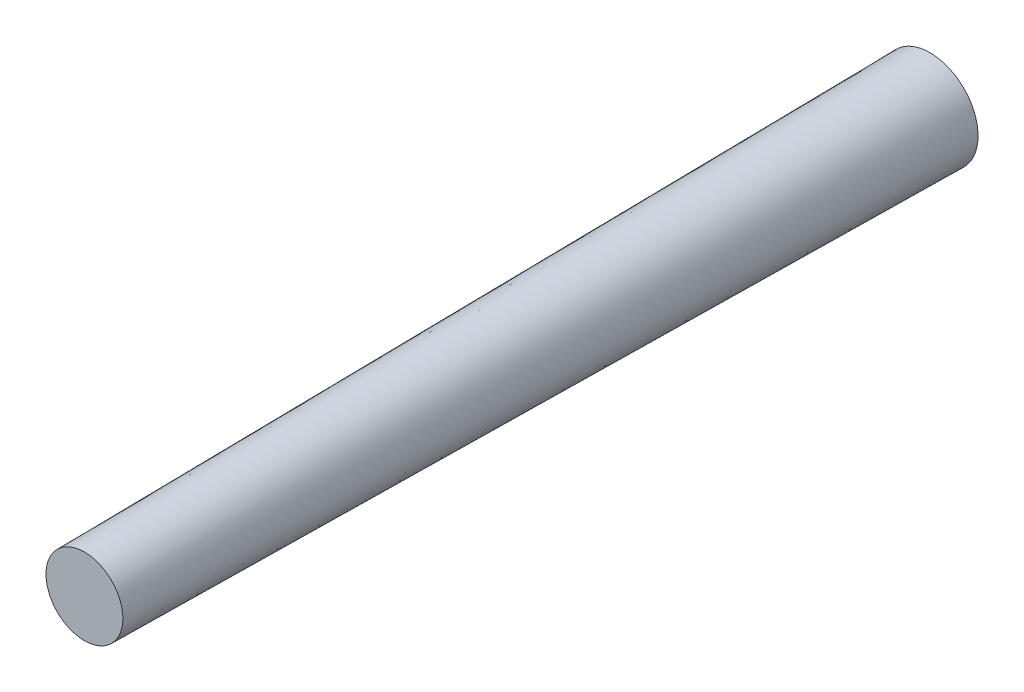
ISO-10303-21;
HEADER;
FILE_DESCRIPTION(('STEP AP214'),'2;1');
FILE_NAME('part.step','',(''),(''),'','','');
FILE_SCHEMA(('AUTOMOTIVE_DESIGN { 1 0 10303 214 1 1 1 1 }'));
ENDSEC;
DATA;
#1=APPLICATION_CONTEXT('core data for automotive mechanical design processes');
#2=APPLICATION_PROTOCOL_DEFINITION('international standard','automotive_design',2000,#1);
#3=PRODUCT_CONTEXT('',#1,'mechanical');
#4=PRODUCT('Part','Part','',(#3));
#5=PRODUCT_RELATED_PRODUCT_CATEGORY('part','',(#4));
#6=PRODUCT_DEFINITION_FORMATION('','',#4);
#7=PRODUCT_DEFINITION_CONTEXT('part definition',#1,'design');
#8=PRODUCT_DEFINITION('design','',#6,#7);
#9=PRODUCT_DEFINITION_SHAPE('','',#8);
#10=(LENGTH_UNIT() NAMED_UNIT(*) SI_UNIT(.MILLI.,.METRE.));
#11=(NAMED_UNIT(*) PLANE_ANGLE_UNIT() SI_UNIT($,.RADIAN.));
#12=(NAMED_UNIT(*) SI_UNIT($,.STERADIAN.) SOLID_ANGLE_UNIT());
#13=UNCERTAINTY_MEASURE_WITH_UNIT(LENGTH_MEASURE(1.E-05),#10,'distance_accuracy_value','');
#14=(GEOMETRIC_REPRESENTATION_CONTEXT(3) GLOBAL_UNCERTAINTY_ASSIGNED_CONTEXT((#13)) GLOBAL_UNIT_ASSIGNED_CONTEXT((#10,
#11,#12)) REPRESENTATION_CONTEXT('',''));
#15=CARTESIAN_POINT('',(0.,0.,0.));
#16=DIRECTION('',(0.,0.,1.));
#17=DIRECTION('',(1.,0.,0.));
#18=AXIS2_PLACEMENT_3D('',#15,#16,#17);
#19=CARTESIAN_POINT('',(2.50000000000001,0.,-22.));
#20=DIRECTION('',(0.,0.,1.));
#21=DIRECTION('',(1.,0.,0.));
#22=AXIS2_PLACEMENT_3D('',#19,#20,#21);
#23=PLANE('',#22);
#24=CARTESIAN_POINT('',(0.,0.,-22.));
#25=DIRECTION('',(0.,0.,-1.));
#26=DIRECTION('',(-1.,0.,0.));
#27=AXIS2_PLACEMENT_3D('',#24,#25,#26);
#28=CIRCLE('',#27,2.50000000000001);
#29=CARTESIAN_POINT('',(-2.50000000000001,0.,-22.));
#30=VERTEX_POINT('',#29);
#31=EDGE_CURVE('E37',#30,#30,#28,.T.);
#32=ORIENTED_EDGE('',*,*,#31,.T.);
#33=EDGE_LOOP('',(#32));
#34=FACE_BOUND('',#33,.T.);
#35=ADVANCED_FACE('F31',(#34),#23,.F.);
#36=CARTESIAN_POINT('',(0.,0.,22.));
#37=DIRECTION('',(0.,0.,-1.));
#38=DIRECTION('',(-1.,0.,0.));
#39=AXIS2_PLACEMENT_3D('',#36,#37,#38);
#40=PLANE('',#39);
#41=CARTESIAN_POINT('',(0.,0.,22.));
#42=DIRECTION('',(0.,0.,-1.));
#43=DIRECTION('',(-1.,0.,0.));
#44=AXIS2_PLACEMENT_3D('',#41,#42,#43);
#45=CIRCLE('',#44,2.00000000000001);
#46=CARTESIAN_POINT('',(-2.00000000000001,0.,22.));
#47=VERTEX_POINT('',#46);
#48=EDGE_CURVE('E10',#47,#47,#45,.T.);
#49=ORIENTED_EDGE('',*,*,#48,.F.);
#50=EDGE_LOOP('',(#49));
#51=FACE_BOUND('',#50,.T.);
#52=ADVANCED_FACE('F46',(#51),#40,.F.);
#53=CARTESIAN_POINT('',(0.,0.,22.));
#54=DIRECTION('',(0.,0.,-1.));
#55=DIRECTION('',(-1.,0.,0.));
#56=AXIS2_PLACEMENT_3D('',#53,#54,#55);
#57=CONICAL_SURFACE('',#56,2.00000000000001,0.0113631472642906);
#58=ORIENTED_EDGE('',*,*,#31,.F.);
#59=EDGE_LOOP('',(#58));
#60=FACE_BOUND('',#59,.T.);
#61=ORIENTED_EDGE('',*,*,#48,.T.);
#62=EDGE_LOOP('',(#61));
#63=FACE_BOUND('',#62,.T.);
#64=ADVANCED_FACE('F44',(#60,#63),#57,.T.);
#65=CLOSED_SHELL('',(#35,#52,#64));
#66=MANIFOLD_SOLID_BREP('B2',#65);
#67=ADVANCED_BREP_SHAPE_REPRESENTATION('',(#18,#66),#14);
#68=SHAPE_DEFINITION_REPRESENTATION(#9,#67);
ENDSEC;
END-ISO-10303-21;
